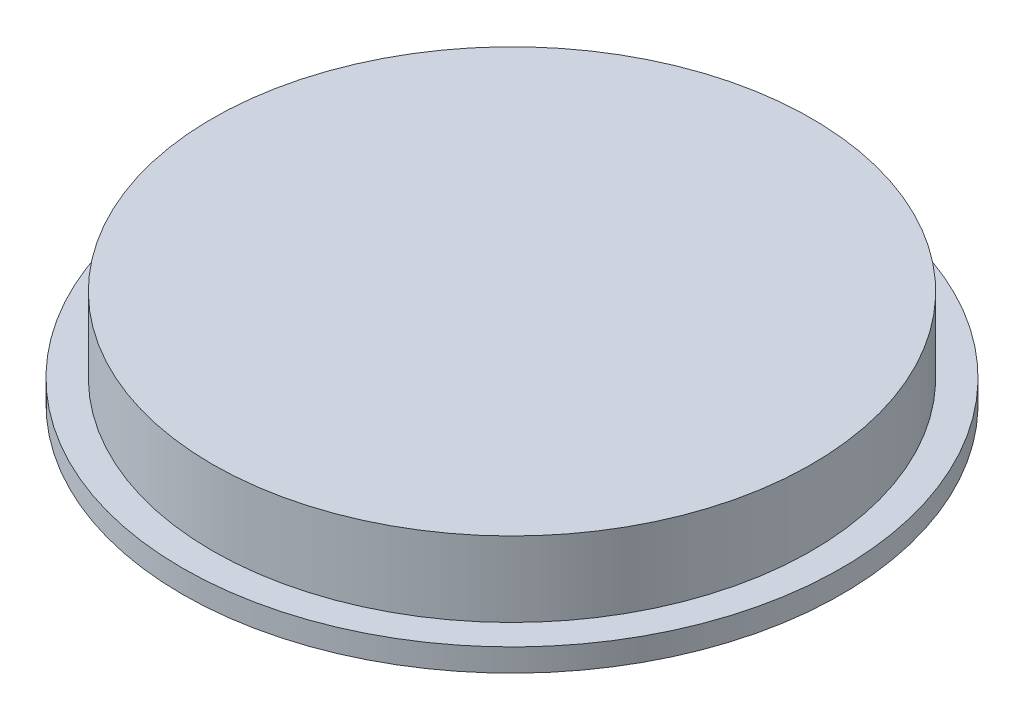
ISO-10303-21;
HEADER;
FILE_DESCRIPTION(('STEP AP214'),'2;1');
FILE_NAME('part.step','',(''),(''),'','','');
FILE_SCHEMA(('AUTOMOTIVE_DESIGN { 1 0 10303 214 1 1 1 1 }'));
ENDSEC;
DATA;
#1=APPLICATION_CONTEXT('core data for automotive mechanical design processes');
#2=APPLICATION_PROTOCOL_DEFINITION('international standard','automotive_design',2000,#1);
#3=PRODUCT_CONTEXT('',#1,'mechanical');
#4=PRODUCT('Part','Part','',(#3));
#5=PRODUCT_RELATED_PRODUCT_CATEGORY('part','',(#4));
#6=PRODUCT_DEFINITION_FORMATION('','',#4);
#7=PRODUCT_DEFINITION_CONTEXT('part definition',#1,'design');
#8=PRODUCT_DEFINITION('design','',#6,#7);
#9=PRODUCT_DEFINITION_SHAPE('','',#8);
#10=(LENGTH_UNIT() NAMED_UNIT(*) SI_UNIT(.MILLI.,.METRE.));
#11=(NAMED_UNIT(*) PLANE_ANGLE_UNIT() SI_UNIT($,.RADIAN.));
#12=(NAMED_UNIT(*) SI_UNIT($,.STERADIAN.) SOLID_ANGLE_UNIT());
#13=UNCERTAINTY_MEASURE_WITH_UNIT(LENGTH_MEASURE(1.E-05),#10,'distance_accuracy_value','');
#14=(GEOMETRIC_REPRESENTATION_CONTEXT(3) GLOBAL_UNCERTAINTY_ASSIGNED_CONTEXT((#13)) GLOBAL_UNIT_ASSIGNED_CONTEXT((#10,
#11,#12)) REPRESENTATION_CONTEXT('',''));
#15=CARTESIAN_POINT('',(0.,0.,0.));
#16=DIRECTION('',(0.,0.,1.));
#17=DIRECTION('',(1.,0.,0.));
#18=AXIS2_PLACEMENT_3D('',#15,#16,#17);
#19=CARTESIAN_POINT('',(0.,13.5168723822455,0.));
#20=DIRECTION('',(0.,-1.,0.));
#21=DIRECTION('',(0.,0.,-1.));
#22=AXIS2_PLACEMENT_3D('',#19,#20,#21);
#23=PLANE('',#22);
#24=CARTESIAN_POINT('',(0.,13.5168723822455,0.));
#25=DIRECTION('',(0.,1.,0.));
#26=DIRECTION('',(0.,0.,1.));
#27=AXIS2_PLACEMENT_3D('',#24,#25,#26);
#28=CIRCLE('',#27,50.8);
#29=CARTESIAN_POINT('',(0.,13.5168723822455,50.8));
#30=VERTEX_POINT('',#29);
#31=EDGE_CURVE('E10',#30,#30,#28,.T.);
#32=ORIENTED_EDGE('',*,*,#31,.T.);
#33=EDGE_LOOP('',(#32));
#34=FACE_BOUND('',#33,.T.);
#35=ADVANCED_FACE('F36',(#34),#23,.F.);
#36=CARTESIAN_POINT('',(0.,45.2931535269709,0.));
#37=DIRECTION('',(0.,1.,0.));
#38=DIRECTION('',(0.,0.,1.));
#39=AXIS2_PLACEMENT_3D('',#36,#37,#38);
#40=CYLINDRICAL_SURFACE('',#39,50.8);
#41=ORIENTED_EDGE('',*,*,#31,.F.);
#42=EDGE_LOOP('',(#41));
#43=FACE_BOUND('',#42,.T.);
#44=CARTESIAN_POINT('',(0.,0.816872382245537,0.));
#45=DIRECTION('',(0.,1.,0.));
#46=DIRECTION('',(0.,0.,1.));
#47=AXIS2_PLACEMENT_3D('',#44,#45,#46);
#48=CIRCLE('',#47,50.8);
#49=CARTESIAN_POINT('',(0.,0.816872382245537,50.8));
#50=VERTEX_POINT('',#49);
#51=EDGE_CURVE('E42',#50,#50,#48,.T.);
#52=ORIENTED_EDGE('',*,*,#51,.T.);
#53=EDGE_LOOP('',(#52));
#54=FACE_BOUND('',#53,.T.);
#55=ADVANCED_FACE('F74',(#43,#54),#40,.T.);
#56=CARTESIAN_POINT('',(55.88,0.816872382245534,0.));
#57=DIRECTION('',(0.,-1.,0.));
#58=DIRECTION('',(0.,0.,-1.));
#59=AXIS2_PLACEMENT_3D('',#56,#57,#58);
#60=PLANE('',#59);
#61=ORIENTED_EDGE('',*,*,#51,.F.);
#62=EDGE_LOOP('',(#61));
#63=FACE_BOUND('',#62,.T.);
#64=CARTESIAN_POINT('',(0.,0.816872382245537,0.));
#65=DIRECTION('',(0.,1.,0.));
#66=DIRECTION('',(0.,0.,1.));
#67=AXIS2_PLACEMENT_3D('',#64,#65,#66);
#68=CIRCLE('',#67,55.88);
#69=CARTESIAN_POINT('',(0.,0.816872382245537,55.88));
#70=VERTEX_POINT('',#69);
#71=EDGE_CURVE('E46',#70,#70,#68,.T.);
#72=ORIENTED_EDGE('',*,*,#71,.T.);
#73=EDGE_LOOP('',(#72));
#74=FACE_BOUND('',#73,.T.);
#75=ADVANCED_FACE('F78',(#63,#74),#60,.F.);
#76=CARTESIAN_POINT('',(0.,45.2931535269709,0.));
#77=DIRECTION('',(0.,1.,0.));
#78=DIRECTION('',(0.,0.,1.));
#79=AXIS2_PLACEMENT_3D('',#76,#77,#78);
#80=CYLINDRICAL_SURFACE('',#79,55.88);
#81=ORIENTED_EDGE('',*,*,#71,.F.);
#82=EDGE_LOOP('',(#81));
#83=FACE_BOUND('',#82,.T.);
#84=CARTESIAN_POINT('',(0.,-3.03674630603943,0.));
#85=DIRECTION('',(0.,1.,0.));
#86=DIRECTION('',(0.,0.,1.));
#87=AXIS2_PLACEMENT_3D('',#84,#85,#86);
#88=CIRCLE('',#87,55.88);
#89=CARTESIAN_POINT('',(0.,-3.03674630603943,55.88));
#90=VERTEX_POINT('',#89);
#91=EDGE_CURVE('E50',#90,#90,#88,.T.);
#92=ORIENTED_EDGE('',*,*,#91,.T.);
#93=EDGE_LOOP('',(#92));
#94=FACE_BOUND('',#93,.T.);
#95=ADVANCED_FACE('F83',(#83,#94),#80,.T.);
#96=CARTESIAN_POINT('',(55.88,-3.03674630603943,0.));
#97=DIRECTION('',(0.,1.,0.));
#98=DIRECTION('',(0.,0.,1.));
#99=AXIS2_PLACEMENT_3D('',#96,#97,#98);
#100=PLANE('',#99);
#101=ORIENTED_EDGE('',*,*,#91,.F.);
#102=EDGE_LOOP('',(#101));
#103=FACE_BOUND('',#102,.T.);
#104=CARTESIAN_POINT('',(0.,-3.03674630603943,0.));
#105=DIRECTION('',(0.,1.,0.));
#106=DIRECTION('',(0.,0.,1.));
#107=AXIS2_PLACEMENT_3D('',#104,#105,#106);
#108=CIRCLE('',#107,47.1598346499696);
#109=CARTESIAN_POINT('',(0.,-3.03674630603943,47.1598346499696));
#110=VERTEX_POINT('',#109);
#111=EDGE_CURVE('E55',#110,#110,#108,.T.);
#112=ORIENTED_EDGE('',*,*,#111,.T.);
#113=EDGE_LOOP('',(#112));
#114=FACE_BOUND('',#113,.T.);
#115=ADVANCED_FACE('F70',(#103,#114),#100,.F.);
#116=CARTESIAN_POINT('',(0.,1.67067494050735,0.));
#117=DIRECTION('',(0.,-1.,0.));
#118=DIRECTION('',(0.,0.,-1.));
#119=AXIS2_PLACEMENT_3D('',#116,#117,#118);
#120=CONICAL_SURFACE('',#119,38.1,1.09159793066619);
#121=ORIENTED_EDGE('',*,*,#111,.F.);
#122=EDGE_LOOP('',(#121));
#123=FACE_BOUND('',#122,.T.);
#124=CARTESIAN_POINT('',(0.,1.67067494050735,0.));
#125=DIRECTION('',(0.,1.,0.));
#126=DIRECTION('',(0.,0.,1.));
#127=AXIS2_PLACEMENT_3D('',#124,#125,#126);
#128=CIRCLE('',#127,38.1);
#129=CARTESIAN_POINT('',(0.,1.67067494050735,38.1));
#130=VERTEX_POINT('',#129);
#131=EDGE_CURVE('E58',#130,#130,#128,.T.);
#132=ORIENTED_EDGE('',*,*,#131,.T.);
#133=EDGE_LOOP('',(#132));
#134=FACE_BOUND('',#133,.T.);
#135=ADVANCED_FACE('F62',(#123,#134),#120,.F.);
#136=CARTESIAN_POINT('',(38.1,1.67067494050735,0.));
#137=DIRECTION('',(0.,1.,0.));
#138=DIRECTION('',(0.,0.,1.));
#139=AXIS2_PLACEMENT_3D('',#136,#137,#138);
#140=PLANE('',#139);
#141=ORIENTED_EDGE('',*,*,#131,.F.);
#142=EDGE_LOOP('',(#141));
#143=FACE_BOUND('',#142,.T.);
#144=ADVANCED_FACE('F64',(#143),#140,.F.);
#145=CLOSED_SHELL('',(#35,#55,#75,#95,#115,#135,#144));
#146=MANIFOLD_SOLID_BREP('B2',#145);
#147=ADVANCED_BREP_SHAPE_REPRESENTATION('',(#18,#146),#14);
#148=SHAPE_DEFINITION_REPRESENTATION(#9,#147);
ENDSEC;
END-ISO-10303-21;
